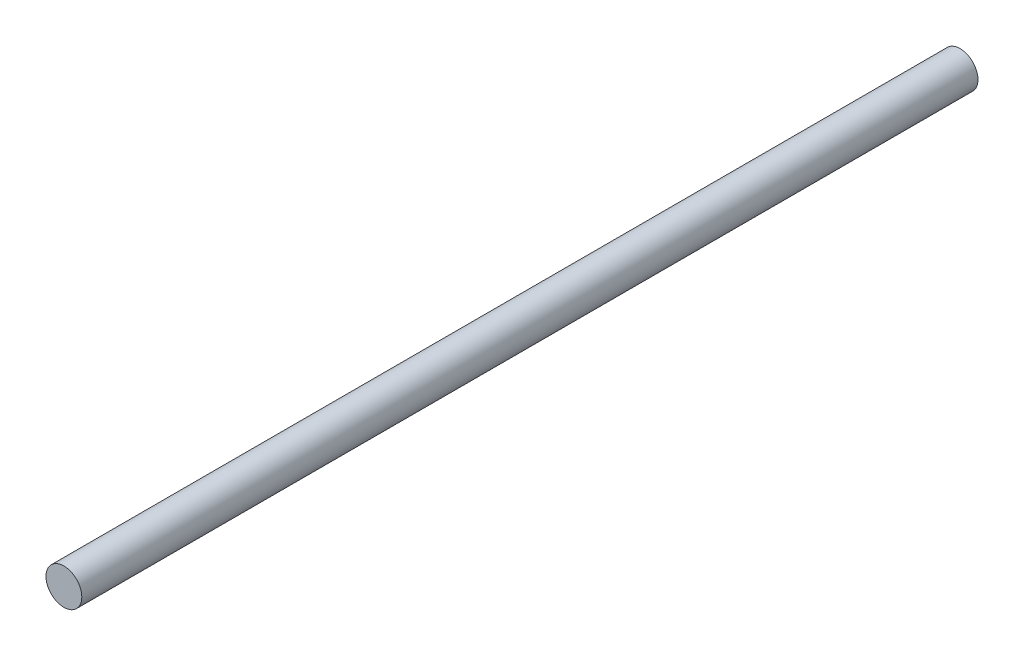
ISO-10303-21;
HEADER;
FILE_DESCRIPTION(('STEP AP214'),'2;1');
FILE_NAME('part.step','',(''),(''),'','','');
FILE_SCHEMA(('AUTOMOTIVE_DESIGN { 1 0 10303 214 1 1 1 1 }'));
ENDSEC;
DATA;
#1=APPLICATION_CONTEXT('core data for automotive mechanical design processes');
#2=APPLICATION_PROTOCOL_DEFINITION('international standard','automotive_design',2000,#1);
#3=PRODUCT_CONTEXT('',#1,'mechanical');
#4=PRODUCT('Part','Part','',(#3));
#5=PRODUCT_RELATED_PRODUCT_CATEGORY('part','',(#4));
#6=PRODUCT_DEFINITION_FORMATION('','',#4);
#7=PRODUCT_DEFINITION_CONTEXT('part definition',#1,'design');
#8=PRODUCT_DEFINITION('design','',#6,#7);
#9=PRODUCT_DEFINITION_SHAPE('','',#8);
#10=(LENGTH_UNIT() NAMED_UNIT(*) SI_UNIT(.MILLI.,.METRE.));
#11=(NAMED_UNIT(*) PLANE_ANGLE_UNIT() SI_UNIT($,.RADIAN.));
#12=(NAMED_UNIT(*) SI_UNIT($,.STERADIAN.) SOLID_ANGLE_UNIT());
#13=UNCERTAINTY_MEASURE_WITH_UNIT(LENGTH_MEASURE(1.E-05),#10,'distance_accuracy_value','');
#14=(GEOMETRIC_REPRESENTATION_CONTEXT(3) GLOBAL_UNCERTAINTY_ASSIGNED_CONTEXT((#13)) GLOBAL_UNIT_ASSIGNED_CONTEXT((#10,
#11,#12)) REPRESENTATION_CONTEXT('',''));
#15=CARTESIAN_POINT('',(0.,0.,0.));
#16=DIRECTION('',(0.,0.,1.));
#17=DIRECTION('',(1.,0.,0.));
#18=AXIS2_PLACEMENT_3D('',#15,#16,#17);
#19=CARTESIAN_POINT('',(0.,0.,100.));
#20=DIRECTION('',(0.,0.,-1.));
#21=DIRECTION('',(-1.,0.,0.));
#22=AXIS2_PLACEMENT_3D('',#19,#20,#21);
#23=CYLINDRICAL_SURFACE('',#22,2.);
#24=CARTESIAN_POINT('',(0.,0.,100.));
#25=DIRECTION('',(0.,0.,1.));
#26=DIRECTION('',(1.,0.,0.));
#27=AXIS2_PLACEMENT_3D('',#24,#25,#26);
#28=CIRCLE('',#27,2.);
#29=CARTESIAN_POINT('',(2.,0.,100.));
#30=VERTEX_POINT('',#29);
#31=EDGE_CURVE('E10',#30,#30,#28,.T.);
#32=ORIENTED_EDGE('',*,*,#31,.F.);
#33=EDGE_LOOP('',(#32));
#34=FACE_BOUND('',#33,.T.);
#35=CARTESIAN_POINT('',(0.,0.,0.));
#36=DIRECTION('',(0.,0.,1.));
#37=DIRECTION('',(1.,0.,0.));
#38=AXIS2_PLACEMENT_3D('',#35,#36,#37);
#39=CIRCLE('',#38,2.);
#40=CARTESIAN_POINT('',(2.,0.,0.));
#41=VERTEX_POINT('',#40);
#42=EDGE_CURVE('E43',#41,#41,#39,.T.);
#43=ORIENTED_EDGE('',*,*,#42,.T.);
#44=EDGE_LOOP('',(#43));
#45=FACE_BOUND('',#44,.T.);
#46=ADVANCED_FACE('F40',(#34,#45),#23,.T.);
#47=CARTESIAN_POINT('',(0.,0.,100.));
#48=DIRECTION('',(0.,0.,1.));
#49=DIRECTION('',(1.,0.,0.));
#50=AXIS2_PLACEMENT_3D('',#47,#48,#49);
#51=PLANE('',#50);
#52=ORIENTED_EDGE('',*,*,#31,.T.);
#53=EDGE_LOOP('',(#52));
#54=FACE_BOUND('',#53,.T.);
#55=ADVANCED_FACE('F57',(#54),#51,.T.);
#56=CARTESIAN_POINT('',(0.,0.,0.));
#57=DIRECTION('',(0.,0.,1.));
#58=DIRECTION('',(1.,0.,0.));
#59=AXIS2_PLACEMENT_3D('',#56,#57,#58);
#60=PLANE('',#59);
#61=ORIENTED_EDGE('',*,*,#42,.F.);
#62=EDGE_LOOP('',(#61));
#63=FACE_BOUND('',#62,.T.);
#64=ADVANCED_FACE('F55',(#63),#60,.F.);
#65=CLOSED_SHELL('',(#46,#55,#64));
#66=MANIFOLD_SOLID_BREP('B2',#65);
#67=ADVANCED_BREP_SHAPE_REPRESENTATION('',(#18,#66),#14);
#68=SHAPE_DEFINITION_REPRESENTATION(#9,#67);
ENDSEC;
END-ISO-10303-21;
